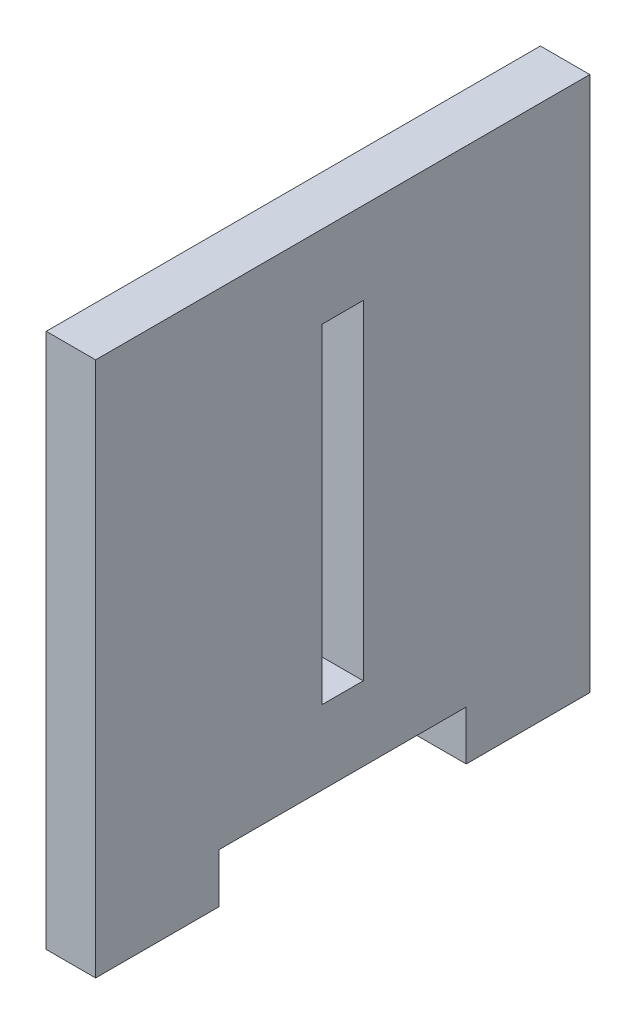
ISO-10303-21;
HEADER;
FILE_DESCRIPTION(('STEP AP214'),'2;1');
FILE_NAME('part.step','',(''),(''),'','','');
FILE_SCHEMA(('AUTOMOTIVE_DESIGN { 1 0 10303 214 1 1 1 1 }'));
ENDSEC;
DATA;
#1=APPLICATION_CONTEXT('core data for automotive mechanical design processes');
#2=APPLICATION_PROTOCOL_DEFINITION('international standard','automotive_design',2000,#1);
#3=PRODUCT_CONTEXT('',#1,'mechanical');
#4=PRODUCT('Part','Part','',(#3));
#5=PRODUCT_RELATED_PRODUCT_CATEGORY('part','',(#4));
#6=PRODUCT_DEFINITION_FORMATION('','',#4);
#7=PRODUCT_DEFINITION_CONTEXT('part definition',#1,'design');
#8=PRODUCT_DEFINITION('design','',#6,#7);
#9=PRODUCT_DEFINITION_SHAPE('','',#8);
#10=(LENGTH_UNIT() NAMED_UNIT(*) SI_UNIT(.MILLI.,.METRE.));
#11=(NAMED_UNIT(*) PLANE_ANGLE_UNIT() SI_UNIT($,.RADIAN.));
#12=(NAMED_UNIT(*) SI_UNIT($,.STERADIAN.) SOLID_ANGLE_UNIT());
#13=UNCERTAINTY_MEASURE_WITH_UNIT(LENGTH_MEASURE(1.E-05),#10,'distance_accuracy_value','');
#14=(GEOMETRIC_REPRESENTATION_CONTEXT(3) GLOBAL_UNCERTAINTY_ASSIGNED_CONTEXT((#13)) GLOBAL_UNIT_ASSIGNED_CONTEXT((#10,
#11,#12)) REPRESENTATION_CONTEXT('',''));
#15=CARTESIAN_POINT('',(0.,0.,0.));
#16=DIRECTION('',(0.,0.,1.));
#17=DIRECTION('',(1.,0.,0.));
#18=AXIS2_PLACEMENT_3D('',#15,#16,#17);
#19=CARTESIAN_POINT('',(6.,0.,0.));
#20=DIRECTION('',(1.,0.,0.));
#21=DIRECTION('',(0.,0.,-1.));
#22=AXIS2_PLACEMENT_3D('',#19,#20,#21);
#23=PLANE('',#22);
#24=DIRECTION('',(0.,-1.,0.));
#25=VECTOR('',#24,1.);
#26=CARTESIAN_POINT('',(6.,65.,60.));
#27=LINE('',#26,#25);
#28=CARTESIAN_POINT('',(6.,65.,60.));
#29=VERTEX_POINT('',#28);
#30=CARTESIAN_POINT('',(6.,0.,60.));
#31=VERTEX_POINT('',#30);
#32=EDGE_CURVE('E158',#29,#31,#27,.T.);
#33=ORIENTED_EDGE('',*,*,#32,.T.);
#34=DIRECTION('',(0.,0.,-1.));
#35=VECTOR('',#34,1.);
#36=CARTESIAN_POINT('',(6.,0.,60.));
#37=LINE('',#36,#35);
#38=CARTESIAN_POINT('',(6.,0.,45.));
#39=VERTEX_POINT('',#38);
#40=EDGE_CURVE('E161',#31,#39,#37,.T.);
#41=ORIENTED_EDGE('',*,*,#40,.T.);
#42=DIRECTION('',(0.,1.,0.));
#43=VECTOR('',#42,1.);
#44=CARTESIAN_POINT('',(6.,0.,45.));
#45=LINE('',#44,#43);
#46=CARTESIAN_POINT('',(6.,6.,45.));
#47=VERTEX_POINT('',#46);
#48=EDGE_CURVE('E164',#39,#47,#45,.T.);
#49=ORIENTED_EDGE('',*,*,#48,.T.);
#50=DIRECTION('',(0.,0.,-1.));
#51=VECTOR('',#50,1.);
#52=CARTESIAN_POINT('',(6.,6.,45.));
#53=LINE('',#52,#51);
#54=CARTESIAN_POINT('',(6.,6.,15.));
#55=VERTEX_POINT('',#54);
#56=EDGE_CURVE('E166',#47,#55,#53,.T.);
#57=ORIENTED_EDGE('',*,*,#56,.T.);
#58=DIRECTION('',(0.,-1.,0.));
#59=VECTOR('',#58,1.);
#60=CARTESIAN_POINT('',(6.,0.,15.));
#61=LINE('',#60,#59);
#62=CARTESIAN_POINT('',(6.,0.,15.));
#63=VERTEX_POINT('',#62);
#64=EDGE_CURVE('E168',#55,#63,#61,.T.);
#65=ORIENTED_EDGE('',*,*,#64,.T.);
#66=DIRECTION('',(0.,0.,-1.));
#67=VECTOR('',#66,1.);
#68=CARTESIAN_POINT('',(6.,0.,15.));
#69=LINE('',#68,#67);
#70=CARTESIAN_POINT('',(6.,0.,0.));
#71=VERTEX_POINT('',#70);
#72=EDGE_CURVE('E170',#63,#71,#69,.T.);
#73=ORIENTED_EDGE('',*,*,#72,.T.);
#74=DIRECTION('',(0.,1.,0.));
#75=VECTOR('',#74,1.);
#76=CARTESIAN_POINT('',(6.,65.,0.));
#77=LINE('',#76,#75);
#78=CARTESIAN_POINT('',(6.,65.,0.));
#79=VERTEX_POINT('',#78);
#80=EDGE_CURVE('E172',#71,#79,#77,.T.);
#81=ORIENTED_EDGE('',*,*,#80,.T.);
#82=DIRECTION('',(0.,0.,1.));
#83=VECTOR('',#82,1.);
#84=CARTESIAN_POINT('',(6.,65.,60.));
#85=LINE('',#84,#83);
#86=EDGE_CURVE('E174',#79,#29,#85,.T.);
#87=ORIENTED_EDGE('',*,*,#86,.T.);
#88=EDGE_LOOP('',(#33,#41,#49,#57,#65,#73,#81,#87));
#89=FACE_BOUND('',#88,.T.);
#90=DIRECTION('',(0.,0.,-1.));
#91=VECTOR('',#90,1.);
#92=CARTESIAN_POINT('',(6.,15.,32.5));
#93=LINE('',#92,#91);
#94=CARTESIAN_POINT('',(6.,15.,32.5));
#95=VERTEX_POINT('',#94);
#96=CARTESIAN_POINT('',(6.,15.,27.5));
#97=VERTEX_POINT('',#96);
#98=EDGE_CURVE('E130',#95,#97,#93,.T.);
#99=ORIENTED_EDGE('',*,*,#98,.F.);
#100=DIRECTION('',(0.,-1.,0.));
#101=VECTOR('',#100,1.);
#102=CARTESIAN_POINT('',(6.,55.,32.5));
#103=LINE('',#102,#101);
#104=CARTESIAN_POINT('',(6.,55.,32.5));
#105=VERTEX_POINT('',#104);
#106=EDGE_CURVE('E122',#105,#95,#103,.T.);
#107=ORIENTED_EDGE('',*,*,#106,.F.);
#108=DIRECTION('',(0.,0.,1.));
#109=VECTOR('',#108,1.);
#110=CARTESIAN_POINT('',(6.,55.,32.5));
#111=LINE('',#110,#109);
#112=CARTESIAN_POINT('',(6.,55.,27.5));
#113=VERTEX_POINT('',#112);
#114=EDGE_CURVE('E144',#113,#105,#111,.T.);
#115=ORIENTED_EDGE('',*,*,#114,.F.);
#116=DIRECTION('',(0.,1.,0.));
#117=VECTOR('',#116,1.);
#118=CARTESIAN_POINT('',(6.,55.,27.5));
#119=LINE('',#118,#117);
#120=EDGE_CURVE('E142',#97,#113,#119,.T.);
#121=ORIENTED_EDGE('',*,*,#120,.F.);
#122=EDGE_LOOP('',(#99,#107,#115,#121));
#123=FACE_BOUND('',#122,.T.);
#124=ADVANCED_FACE('F33',(#89,#123),#23,.T.);
#125=CARTESIAN_POINT('',(0.,0.,0.));
#126=DIRECTION('',(1.,0.,0.));
#127=DIRECTION('',(0.,0.,-1.));
#128=AXIS2_PLACEMENT_3D('',#125,#126,#127);
#129=PLANE('',#128);
#130=DIRECTION('',(0.,-1.,0.));
#131=VECTOR('',#130,1.);
#132=CARTESIAN_POINT('',(0.,65.,60.));
#133=LINE('',#132,#131);
#134=CARTESIAN_POINT('',(0.,65.,60.));
#135=VERTEX_POINT('',#134);
#136=CARTESIAN_POINT('',(0.,0.,60.));
#137=VERTEX_POINT('',#136);
#138=EDGE_CURVE('E138',#135,#137,#133,.T.);
#139=ORIENTED_EDGE('',*,*,#138,.F.);
#140=DIRECTION('',(0.,0.,1.));
#141=VECTOR('',#140,1.);
#142=CARTESIAN_POINT('',(0.,65.,60.));
#143=LINE('',#142,#141);
#144=CARTESIAN_POINT('',(0.,65.,0.));
#145=VERTEX_POINT('',#144);
#146=EDGE_CURVE('E162',#145,#135,#143,.T.);
#147=ORIENTED_EDGE('',*,*,#146,.F.);
#148=DIRECTION('',(0.,1.,0.));
#149=VECTOR('',#148,1.);
#150=CARTESIAN_POINT('',(0.,65.,0.));
#151=LINE('',#150,#149);
#152=CARTESIAN_POINT('',(0.,0.,0.));
#153=VERTEX_POINT('',#152);
#154=EDGE_CURVE('E189',#153,#145,#151,.T.);
#155=ORIENTED_EDGE('',*,*,#154,.F.);
#156=DIRECTION('',(0.,0.,-1.));
#157=VECTOR('',#156,1.);
#158=CARTESIAN_POINT('',(0.,0.,15.));
#159=LINE('',#158,#157);
#160=CARTESIAN_POINT('',(0.,0.,15.));
#161=VERTEX_POINT('',#160);
#162=EDGE_CURVE('E187',#161,#153,#159,.T.);
#163=ORIENTED_EDGE('',*,*,#162,.F.);
#164=DIRECTION('',(0.,-1.,0.));
#165=VECTOR('',#164,1.);
#166=CARTESIAN_POINT('',(0.,0.,15.));
#167=LINE('',#166,#165);
#168=CARTESIAN_POINT('',(0.,6.,15.));
#169=VERTEX_POINT('',#168);
#170=EDGE_CURVE('E185',#169,#161,#167,.T.);
#171=ORIENTED_EDGE('',*,*,#170,.F.);
#172=DIRECTION('',(0.,0.,-1.));
#173=VECTOR('',#172,1.);
#174=CARTESIAN_POINT('',(0.,6.,45.));
#175=LINE('',#174,#173);
#176=CARTESIAN_POINT('',(0.,6.,45.));
#177=VERTEX_POINT('',#176);
#178=EDGE_CURVE('E183',#177,#169,#175,.T.);
#179=ORIENTED_EDGE('',*,*,#178,.F.);
#180=DIRECTION('',(0.,1.,0.));
#181=VECTOR('',#180,1.);
#182=CARTESIAN_POINT('',(0.,0.,45.));
#183=LINE('',#182,#181);
#184=CARTESIAN_POINT('',(0.,0.,45.));
#185=VERTEX_POINT('',#184);
#186=EDGE_CURVE('E181',#185,#177,#183,.T.);
#187=ORIENTED_EDGE('',*,*,#186,.F.);
#188=DIRECTION('',(0.,0.,-1.));
#189=VECTOR('',#188,1.);
#190=CARTESIAN_POINT('',(0.,0.,60.));
#191=LINE('',#190,#189);
#192=EDGE_CURVE('E179',#137,#185,#191,.T.);
#193=ORIENTED_EDGE('',*,*,#192,.F.);
#194=EDGE_LOOP('',(#139,#147,#155,#163,#171,#179,#187,#193));
#195=FACE_BOUND('',#194,.T.);
#196=DIRECTION('',(0.,-1.,0.));
#197=VECTOR('',#196,1.);
#198=CARTESIAN_POINT('',(0.,55.,32.5));
#199=LINE('',#198,#197);
#200=CARTESIAN_POINT('',(0.,55.,32.5));
#201=VERTEX_POINT('',#200);
#202=CARTESIAN_POINT('',(0.,15.,32.5));
#203=VERTEX_POINT('',#202);
#204=EDGE_CURVE('E56',#201,#203,#199,.T.);
#205=ORIENTED_EDGE('',*,*,#204,.T.);
#206=DIRECTION('',(0.,0.,-1.));
#207=VECTOR('',#206,1.);
#208=CARTESIAN_POINT('',(0.,15.,32.5));
#209=LINE('',#208,#207);
#210=CARTESIAN_POINT('',(0.,15.,27.5));
#211=VERTEX_POINT('',#210);
#212=EDGE_CURVE('E137',#203,#211,#209,.T.);
#213=ORIENTED_EDGE('',*,*,#212,.T.);
#214=DIRECTION('',(0.,1.,0.));
#215=VECTOR('',#214,1.);
#216=CARTESIAN_POINT('',(0.,55.,27.5));
#217=LINE('',#216,#215);
#218=CARTESIAN_POINT('',(0.,55.,27.5));
#219=VERTEX_POINT('',#218);
#220=EDGE_CURVE('E150',#211,#219,#217,.T.);
#221=ORIENTED_EDGE('',*,*,#220,.T.);
#222=DIRECTION('',(0.,0.,1.));
#223=VECTOR('',#222,1.);
#224=CARTESIAN_POINT('',(0.,55.,32.5));
#225=LINE('',#224,#223);
#226=EDGE_CURVE('E131',#219,#201,#225,.T.);
#227=ORIENTED_EDGE('',*,*,#226,.T.);
#228=EDGE_LOOP('',(#205,#213,#221,#227));
#229=FACE_BOUND('',#228,.T.);
#230=ADVANCED_FACE('F219',(#195,#229),#129,.F.);
#231=CARTESIAN_POINT('',(6.,65.,60.));
#232=DIRECTION('',(0.,0.,-1.));
#233=DIRECTION('',(0.,1.,0.));
#234=AXIS2_PLACEMENT_3D('',#231,#232,#233);
#235=PLANE('',#234);
#236=ORIENTED_EDGE('',*,*,#138,.T.);
#237=DIRECTION('',(-1.,0.,0.));
#238=VECTOR('',#237,1.);
#239=CARTESIAN_POINT('',(6.,0.,60.));
#240=LINE('',#239,#238);
#241=EDGE_CURVE('E11',#31,#137,#240,.T.);
#242=ORIENTED_EDGE('',*,*,#241,.F.);
#243=ORIENTED_EDGE('',*,*,#32,.F.);
#244=DIRECTION('',(-1.,0.,0.));
#245=VECTOR('',#244,1.);
#246=CARTESIAN_POINT('',(6.,65.,60.));
#247=LINE('',#246,#245);
#248=EDGE_CURVE('E176',#29,#135,#247,.T.);
#249=ORIENTED_EDGE('',*,*,#248,.T.);
#250=EDGE_LOOP('',(#236,#242,#243,#249));
#251=FACE_BOUND('',#250,.T.);
#252=ADVANCED_FACE('F35',(#251),#235,.F.);
#253=CARTESIAN_POINT('',(6.,0.,60.));
#254=DIRECTION('',(0.,1.,0.));
#255=DIRECTION('',(0.,0.,1.));
#256=AXIS2_PLACEMENT_3D('',#253,#254,#255);
#257=PLANE('',#256);
#258=ORIENTED_EDGE('',*,*,#192,.T.);
#259=DIRECTION('',(-1.,0.,0.));
#260=VECTOR('',#259,1.);
#261=CARTESIAN_POINT('',(6.,0.,45.));
#262=LINE('',#261,#260);
#263=EDGE_CURVE('E41',#39,#185,#262,.T.);
#264=ORIENTED_EDGE('',*,*,#263,.F.);
#265=ORIENTED_EDGE('',*,*,#40,.F.);
#266=ORIENTED_EDGE('',*,*,#241,.T.);
#267=EDGE_LOOP('',(#258,#264,#265,#266));
#268=FACE_BOUND('',#267,.T.);
#269=ADVANCED_FACE('F236',(#268),#257,.F.);
#270=CARTESIAN_POINT('',(6.,0.,45.));
#271=DIRECTION('',(0.,0.,1.));
#272=DIRECTION('',(1.,0.,0.));
#273=AXIS2_PLACEMENT_3D('',#270,#271,#272);
#274=PLANE('',#273);
#275=ORIENTED_EDGE('',*,*,#186,.T.);
#276=DIRECTION('',(-1.,0.,0.));
#277=VECTOR('',#276,1.);
#278=CARTESIAN_POINT('',(6.,6.,45.));
#279=LINE('',#278,#277);
#280=EDGE_CURVE('E206',#47,#177,#279,.T.);
#281=ORIENTED_EDGE('',*,*,#280,.F.);
#282=ORIENTED_EDGE('',*,*,#48,.F.);
#283=ORIENTED_EDGE('',*,*,#263,.T.);
#284=EDGE_LOOP('',(#275,#281,#282,#283));
#285=FACE_BOUND('',#284,.T.);
#286=ADVANCED_FACE('F213',(#285),#274,.F.);
#287=CARTESIAN_POINT('',(6.,6.,45.));
#288=DIRECTION('',(0.,1.,0.));
#289=DIRECTION('',(0.,0.,1.));
#290=AXIS2_PLACEMENT_3D('',#287,#288,#289);
#291=PLANE('',#290);
#292=ORIENTED_EDGE('',*,*,#178,.T.);
#293=DIRECTION('',(-1.,0.,0.));
#294=VECTOR('',#293,1.);
#295=CARTESIAN_POINT('',(6.,6.,15.));
#296=LINE('',#295,#294);
#297=EDGE_CURVE('E203',#55,#169,#296,.T.);
#298=ORIENTED_EDGE('',*,*,#297,.F.);
#299=ORIENTED_EDGE('',*,*,#56,.F.);
#300=ORIENTED_EDGE('',*,*,#280,.T.);
#301=EDGE_LOOP('',(#292,#298,#299,#300));
#302=FACE_BOUND('',#301,.T.);
#303=ADVANCED_FACE('F225',(#302),#291,.F.);
#304=CARTESIAN_POINT('',(6.,0.,15.));
#305=DIRECTION('',(0.,0.,-1.));
#306=DIRECTION('',(-1.,0.,0.));
#307=AXIS2_PLACEMENT_3D('',#304,#305,#306);
#308=PLANE('',#307);
#309=ORIENTED_EDGE('',*,*,#170,.T.);
#310=DIRECTION('',(-1.,0.,0.));
#311=VECTOR('',#310,1.);
#312=CARTESIAN_POINT('',(6.,0.,15.));
#313=LINE('',#312,#311);
#314=EDGE_CURVE('E200',#63,#161,#313,.T.);
#315=ORIENTED_EDGE('',*,*,#314,.F.);
#316=ORIENTED_EDGE('',*,*,#64,.F.);
#317=ORIENTED_EDGE('',*,*,#297,.T.);
#318=EDGE_LOOP('',(#309,#315,#316,#317));
#319=FACE_BOUND('',#318,.T.);
#320=ADVANCED_FACE('F229',(#319),#308,.F.);
#321=CARTESIAN_POINT('',(6.,0.,15.));
#322=DIRECTION('',(0.,1.,0.));
#323=DIRECTION('',(0.,0.,1.));
#324=AXIS2_PLACEMENT_3D('',#321,#322,#323);
#325=PLANE('',#324);
#326=ORIENTED_EDGE('',*,*,#162,.T.);
#327=DIRECTION('',(-1.,0.,0.));
#328=VECTOR('',#327,1.);
#329=CARTESIAN_POINT('',(6.,0.,0.));
#330=LINE('',#329,#328);
#331=EDGE_CURVE('E197',#71,#153,#330,.T.);
#332=ORIENTED_EDGE('',*,*,#331,.F.);
#333=ORIENTED_EDGE('',*,*,#72,.F.);
#334=ORIENTED_EDGE('',*,*,#314,.T.);
#335=EDGE_LOOP('',(#326,#332,#333,#334));
#336=FACE_BOUND('',#335,.T.);
#337=ADVANCED_FACE('F249',(#336),#325,.F.);
#338=CARTESIAN_POINT('',(6.,65.,0.));
#339=DIRECTION('',(0.,0.,1.));
#340=DIRECTION('',(0.,-1.,0.));
#341=AXIS2_PLACEMENT_3D('',#338,#339,#340);
#342=PLANE('',#341);
#343=ORIENTED_EDGE('',*,*,#154,.T.);
#344=DIRECTION('',(-1.,0.,0.));
#345=VECTOR('',#344,1.);
#346=CARTESIAN_POINT('',(6.,65.,0.));
#347=LINE('',#346,#345);
#348=EDGE_CURVE('E194',#79,#145,#347,.T.);
#349=ORIENTED_EDGE('',*,*,#348,.F.);
#350=ORIENTED_EDGE('',*,*,#80,.F.);
#351=ORIENTED_EDGE('',*,*,#331,.T.);
#352=EDGE_LOOP('',(#343,#349,#350,#351));
#353=FACE_BOUND('',#352,.T.);
#354=ADVANCED_FACE('F247',(#353),#342,.F.);
#355=CARTESIAN_POINT('',(6.,65.,60.));
#356=DIRECTION('',(0.,-1.,0.));
#357=DIRECTION('',(0.,0.,-1.));
#358=AXIS2_PLACEMENT_3D('',#355,#356,#357);
#359=PLANE('',#358);
#360=ORIENTED_EDGE('',*,*,#146,.T.);
#361=ORIENTED_EDGE('',*,*,#248,.F.);
#362=ORIENTED_EDGE('',*,*,#86,.F.);
#363=ORIENTED_EDGE('',*,*,#348,.T.);
#364=EDGE_LOOP('',(#360,#361,#362,#363));
#365=FACE_BOUND('',#364,.T.);
#366=ADVANCED_FACE('F242',(#365),#359,.F.);
#367=CARTESIAN_POINT('',(6.,55.,32.5));
#368=DIRECTION('',(0.,0.,-1.));
#369=DIRECTION('',(0.,1.,0.));
#370=AXIS2_PLACEMENT_3D('',#367,#368,#369);
#371=PLANE('',#370);
#372=ORIENTED_EDGE('',*,*,#204,.F.);
#373=DIRECTION('',(-1.,0.,0.));
#374=VECTOR('',#373,1.);
#375=CARTESIAN_POINT('',(6.,55.,32.5));
#376=LINE('',#375,#374);
#377=EDGE_CURVE('E126',#105,#201,#376,.T.);
#378=ORIENTED_EDGE('',*,*,#377,.F.);
#379=ORIENTED_EDGE('',*,*,#106,.T.);
#380=DIRECTION('',(-1.,0.,0.));
#381=VECTOR('',#380,1.);
#382=CARTESIAN_POINT('',(6.,15.,32.5));
#383=LINE('',#382,#381);
#384=EDGE_CURVE('E125',#95,#203,#383,.T.);
#385=ORIENTED_EDGE('',*,*,#384,.T.);
#386=EDGE_LOOP('',(#372,#378,#379,#385));
#387=FACE_BOUND('',#386,.T.);
#388=ADVANCED_FACE('F124',(#387),#371,.T.);
#389=CARTESIAN_POINT('',(6.,15.,32.5));
#390=DIRECTION('',(0.,1.,0.));
#391=DIRECTION('',(0.,0.,1.));
#392=AXIS2_PLACEMENT_3D('',#389,#390,#391);
#393=PLANE('',#392);
#394=ORIENTED_EDGE('',*,*,#212,.F.);
#395=ORIENTED_EDGE('',*,*,#384,.F.);
#396=ORIENTED_EDGE('',*,*,#98,.T.);
#397=DIRECTION('',(-1.,0.,0.));
#398=VECTOR('',#397,1.);
#399=CARTESIAN_POINT('',(6.,15.,27.5));
#400=LINE('',#399,#398);
#401=EDGE_CURVE('E139',#97,#211,#400,.T.);
#402=ORIENTED_EDGE('',*,*,#401,.T.);
#403=EDGE_LOOP('',(#394,#395,#396,#402));
#404=FACE_BOUND('',#403,.T.);
#405=ADVANCED_FACE('F134',(#404),#393,.T.);
#406=CARTESIAN_POINT('',(6.,55.,27.5));
#407=DIRECTION('',(0.,0.,1.));
#408=DIRECTION('',(0.,-1.,0.));
#409=AXIS2_PLACEMENT_3D('',#406,#407,#408);
#410=PLANE('',#409);
#411=ORIENTED_EDGE('',*,*,#220,.F.);
#412=ORIENTED_EDGE('',*,*,#401,.F.);
#413=ORIENTED_EDGE('',*,*,#120,.T.);
#414=DIRECTION('',(-1.,0.,0.));
#415=VECTOR('',#414,1.);
#416=CARTESIAN_POINT('',(6.,55.,27.5));
#417=LINE('',#416,#415);
#418=EDGE_CURVE('E48',#113,#219,#417,.T.);
#419=ORIENTED_EDGE('',*,*,#418,.T.);
#420=EDGE_LOOP('',(#411,#412,#413,#419));
#421=FACE_BOUND('',#420,.T.);
#422=ADVANCED_FACE('F274',(#421),#410,.T.);
#423=CARTESIAN_POINT('',(6.,55.,32.5));
#424=DIRECTION('',(0.,-1.,0.));
#425=DIRECTION('',(0.,0.,-1.));
#426=AXIS2_PLACEMENT_3D('',#423,#424,#425);
#427=PLANE('',#426);
#428=ORIENTED_EDGE('',*,*,#226,.F.);
#429=ORIENTED_EDGE('',*,*,#418,.F.);
#430=ORIENTED_EDGE('',*,*,#114,.T.);
#431=ORIENTED_EDGE('',*,*,#377,.T.);
#432=EDGE_LOOP('',(#428,#429,#430,#431));
#433=FACE_BOUND('',#432,.T.);
#434=ADVANCED_FACE('F278',(#433),#427,.T.);
#435=CLOSED_SHELL('',(#124,#230,#252,#269,#286,#303,#320,#337,#354,#366,#388,#405,#422,#434));
#436=MANIFOLD_SOLID_BREP('B2',#435);
#437=ADVANCED_BREP_SHAPE_REPRESENTATION('',(#18,#436),#14);
#438=SHAPE_DEFINITION_REPRESENTATION(#9,#437);
ENDSEC;
END-ISO-10303-21;
